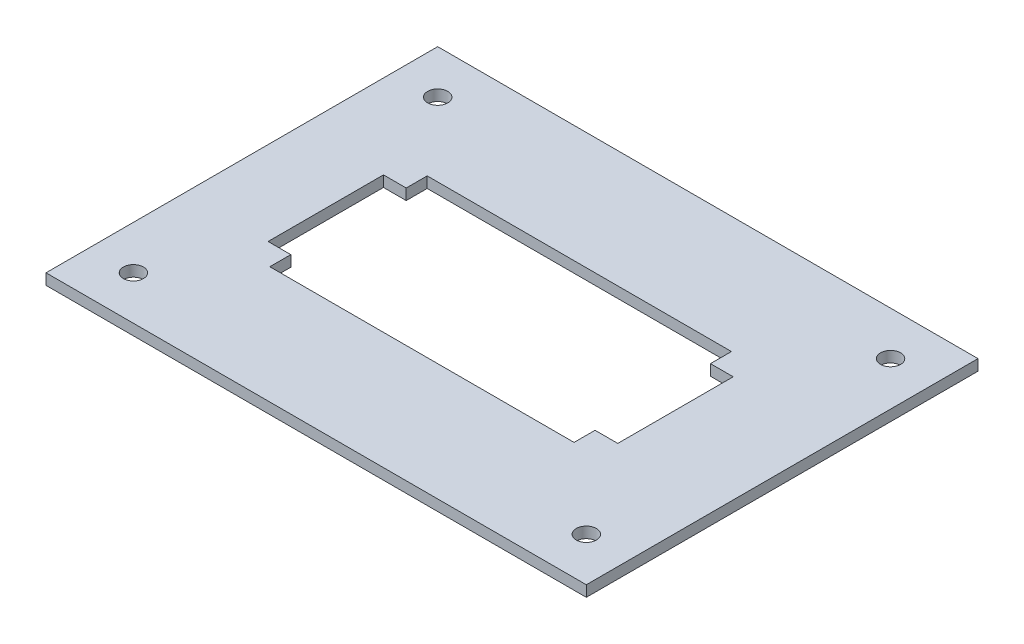
ISO-10303-21;
HEADER;
FILE_DESCRIPTION(('STEP AP214'),'2;1');
FILE_NAME('part.step','',(''),(''),'','','');
FILE_SCHEMA(('AUTOMOTIVE_DESIGN { 1 0 10303 214 1 1 1 1 }'));
ENDSEC;
DATA;
#1=APPLICATION_CONTEXT('core data for automotive mechanical design processes');
#2=APPLICATION_PROTOCOL_DEFINITION('international standard','automotive_design',2000,#1);
#3=PRODUCT_CONTEXT('',#1,'mechanical');
#4=PRODUCT('Part','Part','',(#3));
#5=PRODUCT_RELATED_PRODUCT_CATEGORY('part','',(#4));
#6=PRODUCT_DEFINITION_FORMATION('','',#4);
#7=PRODUCT_DEFINITION_CONTEXT('part definition',#1,'design');
#8=PRODUCT_DEFINITION('design','',#6,#7);
#9=PRODUCT_DEFINITION_SHAPE('','',#8);
#10=(LENGTH_UNIT() NAMED_UNIT(*) SI_UNIT(.MILLI.,.METRE.));
#11=(NAMED_UNIT(*) PLANE_ANGLE_UNIT() SI_UNIT($,.RADIAN.));
#12=(NAMED_UNIT(*) SI_UNIT($,.STERADIAN.) SOLID_ANGLE_UNIT());
#13=UNCERTAINTY_MEASURE_WITH_UNIT(LENGTH_MEASURE(1.E-05),#10,'distance_accuracy_value','');
#14=(GEOMETRIC_REPRESENTATION_CONTEXT(3) GLOBAL_UNCERTAINTY_ASSIGNED_CONTEXT((#13)) GLOBAL_UNIT_ASSIGNED_CONTEXT((#10,
#11,#12)) REPRESENTATION_CONTEXT('',''));
#15=CARTESIAN_POINT('',(0.,0.,0.));
#16=DIRECTION('',(0.,0.,1.));
#17=DIRECTION('',(1.,0.,0.));
#18=AXIS2_PLACEMENT_3D('',#15,#16,#17);
#19=CARTESIAN_POINT('',(0.,1.5875,0.));
#20=DIRECTION('',(0.,-1.,0.));
#21=DIRECTION('',(0.,0.,-1.));
#22=AXIS2_PLACEMENT_3D('',#19,#20,#21);
#23=PLANE('',#22);
#24=CARTESIAN_POINT('',(6.35,1.5875,-6.35));
#25=DIRECTION('',(0.,1.,0.));
#26=DIRECTION('',(0.,0.,1.));
#27=AXIS2_PLACEMENT_3D('',#24,#25,#26);
#28=CIRCLE('',#27,1.4605);
#29=CARTESIAN_POINT('',(6.35,1.5875,-4.8895));
#30=VERTEX_POINT('',#29);
#31=EDGE_CURVE('E388',#30,#30,#28,.T.);
#32=ORIENTED_EDGE('',*,*,#31,.F.);
#33=EDGE_LOOP('',(#32));
#34=FACE_BOUND('',#33,.T.);
#35=CARTESIAN_POINT('',(72.136,1.5875,-50.546));
#36=DIRECTION('',(0.,1.,0.));
#37=DIRECTION('',(0.,0.,1.));
#38=AXIS2_PLACEMENT_3D('',#35,#36,#37);
#39=CIRCLE('',#38,1.4605);
#40=CARTESIAN_POINT('',(72.136,1.5875,-49.0855));
#41=VERTEX_POINT('',#40);
#42=EDGE_CURVE('E381',#41,#41,#39,.T.);
#43=ORIENTED_EDGE('',*,*,#42,.F.);
#44=EDGE_LOOP('',(#43));
#45=FACE_BOUND('',#44,.T.);
#46=CARTESIAN_POINT('',(72.136,1.5875,-6.35));
#47=DIRECTION('',(0.,1.,0.));
#48=DIRECTION('',(0.,0.,1.));
#49=AXIS2_PLACEMENT_3D('',#46,#47,#48);
#50=CIRCLE('',#49,1.4605);
#51=CARTESIAN_POINT('',(72.136,1.5875,-4.8895));
#52=VERTEX_POINT('',#51);
#53=EDGE_CURVE('E378',#52,#52,#50,.T.);
#54=ORIENTED_EDGE('',*,*,#53,.F.);
#55=EDGE_LOOP('',(#54));
#56=FACE_BOUND('',#55,.T.);
#57=CARTESIAN_POINT('',(6.35,1.5875,-50.546));
#58=DIRECTION('',(0.,1.,0.));
#59=DIRECTION('',(0.,0.,1.));
#60=AXIS2_PLACEMENT_3D('',#57,#58,#59);
#61=CIRCLE('',#60,1.4605);
#62=CARTESIAN_POINT('',(6.35,1.5875,-49.0855));
#63=VERTEX_POINT('',#62);
#64=EDGE_CURVE('E387',#63,#63,#61,.T.);
#65=ORIENTED_EDGE('',*,*,#64,.F.);
#66=EDGE_LOOP('',(#65));
#67=FACE_BOUND('',#66,.T.);
#68=DIRECTION('',(0.,0.,1.));
#69=VECTOR('',#68,1.);
#70=CARTESIAN_POINT('',(0.,1.5875,0.));
#71=LINE('',#70,#69);
#72=CARTESIAN_POINT('',(0.,1.5875,-56.896));
#73=VERTEX_POINT('',#72);
#74=CARTESIAN_POINT('',(0.,1.5875,0.));
#75=VERTEX_POINT('',#74);
#76=EDGE_CURVE('E243',#73,#75,#71,.T.);
#77=ORIENTED_EDGE('',*,*,#76,.T.);
#78=DIRECTION('',(1.,0.,0.));
#79=VECTOR('',#78,1.);
#80=CARTESIAN_POINT('',(0.,1.5875,0.));
#81=LINE('',#80,#79);
#82=CARTESIAN_POINT('',(78.486,1.5875,0.));
#83=VERTEX_POINT('',#82);
#84=EDGE_CURVE('E246',#75,#83,#81,.T.);
#85=ORIENTED_EDGE('',*,*,#84,.T.);
#86=DIRECTION('',(0.,0.,-1.));
#87=VECTOR('',#86,1.);
#88=CARTESIAN_POINT('',(78.486,1.5875,0.));
#89=LINE('',#88,#87);
#90=CARTESIAN_POINT('',(78.486,1.5875,-56.896));
#91=VERTEX_POINT('',#90);
#92=EDGE_CURVE('E249',#83,#91,#89,.T.);
#93=ORIENTED_EDGE('',*,*,#92,.T.);
#94=DIRECTION('',(-1.,0.,0.));
#95=VECTOR('',#94,1.);
#96=CARTESIAN_POINT('',(0.,1.5875,-56.896));
#97=LINE('',#96,#95);
#98=EDGE_CURVE('E251',#91,#73,#97,.T.);
#99=ORIENTED_EDGE('',*,*,#98,.T.);
#100=EDGE_LOOP('',(#77,#85,#93,#99));
#101=FACE_BOUND('',#100,.T.);
#102=DIRECTION('',(0.,0.,1.));
#103=VECTOR('',#102,1.);
#104=CARTESIAN_POINT('',(15.494,1.5875,-36.83));
#105=LINE('',#104,#103);
#106=CARTESIAN_POINT('',(15.494,1.5875,-39.878));
#107=VERTEX_POINT('',#106);
#108=CARTESIAN_POINT('',(15.494,1.5875,-36.83));
#109=VERTEX_POINT('',#108);
#110=EDGE_CURVE('E148',#107,#109,#105,.T.);
#111=ORIENTED_EDGE('',*,*,#110,.F.);
#112=DIRECTION('',(-1.,0.,0.));
#113=VECTOR('',#112,1.);
#114=CARTESIAN_POINT('',(15.494,1.5875,-39.878));
#115=LINE('',#114,#113);
#116=CARTESIAN_POINT('',(59.69,1.5875,-39.878));
#117=VERTEX_POINT('',#116);
#118=EDGE_CURVE('E190',#117,#107,#115,.T.);
#119=ORIENTED_EDGE('',*,*,#118,.F.);
#120=DIRECTION('',(0.,0.,-1.));
#121=VECTOR('',#120,1.);
#122=CARTESIAN_POINT('',(59.69,1.5875,-39.878));
#123=LINE('',#122,#121);
#124=CARTESIAN_POINT('',(59.69,1.5875,-36.83));
#125=VERTEX_POINT('',#124);
#126=EDGE_CURVE('E188',#125,#117,#123,.T.);
#127=ORIENTED_EDGE('',*,*,#126,.F.);
#128=DIRECTION('',(-1.,0.,0.));
#129=VECTOR('',#128,1.);
#130=CARTESIAN_POINT('',(59.69,1.5875,-36.83));
#131=LINE('',#130,#129);
#132=CARTESIAN_POINT('',(62.992,1.5875,-36.83));
#133=VERTEX_POINT('',#132);
#134=EDGE_CURVE('E186',#133,#125,#131,.T.);
#135=ORIENTED_EDGE('',*,*,#134,.F.);
#136=DIRECTION('',(0.,0.,-1.));
#137=VECTOR('',#136,1.);
#138=CARTESIAN_POINT('',(62.992,1.5875,-36.83));
#139=LINE('',#138,#137);
#140=CARTESIAN_POINT('',(62.992,1.5875,-20.066));
#141=VERTEX_POINT('',#140);
#142=EDGE_CURVE('E184',#141,#133,#139,.T.);
#143=ORIENTED_EDGE('',*,*,#142,.F.);
#144=DIRECTION('',(1.,0.,0.));
#145=VECTOR('',#144,1.);
#146=CARTESIAN_POINT('',(62.992,1.5875,-20.066));
#147=LINE('',#146,#145);
#148=CARTESIAN_POINT('',(59.69,1.5875,-20.066));
#149=VERTEX_POINT('',#148);
#150=EDGE_CURVE('E182',#149,#141,#147,.T.);
#151=ORIENTED_EDGE('',*,*,#150,.F.);
#152=DIRECTION('',(0.,0.,-1.));
#153=VECTOR('',#152,1.);
#154=CARTESIAN_POINT('',(59.69,1.5875,-20.066));
#155=LINE('',#154,#153);
#156=CARTESIAN_POINT('',(59.69,1.5875,-17.018));
#157=VERTEX_POINT('',#156);
#158=EDGE_CURVE('E180',#157,#149,#155,.T.);
#159=ORIENTED_EDGE('',*,*,#158,.F.);
#160=DIRECTION('',(1.,0.,0.));
#161=VECTOR('',#160,1.);
#162=CARTESIAN_POINT('',(59.69,1.5875,-17.018));
#163=LINE('',#162,#161);
#164=CARTESIAN_POINT('',(15.494,1.5875,-17.018));
#165=VERTEX_POINT('',#164);
#166=EDGE_CURVE('E178',#165,#157,#163,.T.);
#167=ORIENTED_EDGE('',*,*,#166,.F.);
#168=DIRECTION('',(0.,0.,1.));
#169=VECTOR('',#168,1.);
#170=CARTESIAN_POINT('',(15.494,1.5875,-17.018));
#171=LINE('',#170,#169);
#172=CARTESIAN_POINT('',(15.494,1.5875,-20.066));
#173=VERTEX_POINT('',#172);
#174=EDGE_CURVE('E176',#173,#165,#171,.T.);
#175=ORIENTED_EDGE('',*,*,#174,.F.);
#176=DIRECTION('',(1.,0.,0.));
#177=VECTOR('',#176,1.);
#178=CARTESIAN_POINT('',(15.494,1.5875,-20.066));
#179=LINE('',#178,#177);
#180=CARTESIAN_POINT('',(12.192,1.5875,-20.066));
#181=VERTEX_POINT('',#180);
#182=EDGE_CURVE('E171',#181,#173,#179,.T.);
#183=ORIENTED_EDGE('',*,*,#182,.F.);
#184=DIRECTION('',(0.,0.,1.));
#185=VECTOR('',#184,1.);
#186=CARTESIAN_POINT('',(12.192,1.5875,-20.066));
#187=LINE('',#186,#185);
#188=CARTESIAN_POINT('',(12.192,1.5875,-36.83));
#189=VERTEX_POINT('',#188);
#190=EDGE_CURVE('E169',#189,#181,#187,.T.);
#191=ORIENTED_EDGE('',*,*,#190,.F.);
#192=DIRECTION('',(-1.,0.,0.));
#193=VECTOR('',#192,1.);
#194=CARTESIAN_POINT('',(12.192,1.5875,-36.83));
#195=LINE('',#194,#193);
#196=EDGE_CURVE('E156',#109,#189,#195,.T.);
#197=ORIENTED_EDGE('',*,*,#196,.F.);
#198=EDGE_LOOP('',(#111,#119,#127,#135,#143,#151,#159,#167,#175,#183,#191,#197));
#199=FACE_BOUND('',#198,.T.);
#200=ADVANCED_FACE('F35',(#34,#45,#56,#67,#101,#199),#23,.F.);
#201=CARTESIAN_POINT('',(0.,0.,0.));
#202=DIRECTION('',(0.,-1.,0.));
#203=DIRECTION('',(0.,0.,-1.));
#204=AXIS2_PLACEMENT_3D('',#201,#202,#203);
#205=PLANE('',#204);
#206=CARTESIAN_POINT('',(6.35,0.,-6.35));
#207=DIRECTION('',(0.,1.,0.));
#208=DIRECTION('',(0.,0.,1.));
#209=AXIS2_PLACEMENT_3D('',#206,#207,#208);
#210=CIRCLE('',#209,1.4605);
#211=CARTESIAN_POINT('',(6.35,0.,-4.8895));
#212=VERTEX_POINT('',#211);
#213=EDGE_CURVE('E384',#212,#212,#210,.T.);
#214=ORIENTED_EDGE('',*,*,#213,.T.);
#215=EDGE_LOOP('',(#214));
#216=FACE_BOUND('',#215,.T.);
#217=CARTESIAN_POINT('',(72.136,0.,-50.546));
#218=DIRECTION('',(0.,1.,0.));
#219=DIRECTION('',(0.,0.,1.));
#220=AXIS2_PLACEMENT_3D('',#217,#218,#219);
#221=CIRCLE('',#220,1.4605);
#222=CARTESIAN_POINT('',(72.136,0.,-49.0855));
#223=VERTEX_POINT('',#222);
#224=EDGE_CURVE('E391',#223,#223,#221,.T.);
#225=ORIENTED_EDGE('',*,*,#224,.T.);
#226=EDGE_LOOP('',(#225));
#227=FACE_BOUND('',#226,.T.);
#228=CARTESIAN_POINT('',(72.136,0.,-6.35));
#229=DIRECTION('',(0.,1.,0.));
#230=DIRECTION('',(0.,0.,1.));
#231=AXIS2_PLACEMENT_3D('',#228,#229,#230);
#232=CIRCLE('',#231,1.4605);
#233=CARTESIAN_POINT('',(72.136,0.,-4.8895));
#234=VERTEX_POINT('',#233);
#235=EDGE_CURVE('E375',#234,#234,#232,.T.);
#236=ORIENTED_EDGE('',*,*,#235,.T.);
#237=EDGE_LOOP('',(#236));
#238=FACE_BOUND('',#237,.T.);
#239=CARTESIAN_POINT('',(6.35,0.,-50.546));
#240=DIRECTION('',(0.,1.,0.));
#241=DIRECTION('',(0.,0.,1.));
#242=AXIS2_PLACEMENT_3D('',#239,#240,#241);
#243=CIRCLE('',#242,1.4605);
#244=CARTESIAN_POINT('',(6.35,0.,-49.0855));
#245=VERTEX_POINT('',#244);
#246=EDGE_CURVE('E193',#245,#245,#243,.T.);
#247=ORIENTED_EDGE('',*,*,#246,.T.);
#248=EDGE_LOOP('',(#247));
#249=FACE_BOUND('',#248,.T.);
#250=DIRECTION('',(0.,0.,1.));
#251=VECTOR('',#250,1.);
#252=CARTESIAN_POINT('',(0.,0.,0.));
#253=LINE('',#252,#251);
#254=CARTESIAN_POINT('',(0.,0.,-56.896));
#255=VERTEX_POINT('',#254);
#256=CARTESIAN_POINT('',(0.,0.,0.));
#257=VERTEX_POINT('',#256);
#258=EDGE_CURVE('E164',#255,#257,#253,.T.);
#259=ORIENTED_EDGE('',*,*,#258,.F.);
#260=DIRECTION('',(-1.,0.,0.));
#261=VECTOR('',#260,1.);
#262=CARTESIAN_POINT('',(0.,0.,-56.896));
#263=LINE('',#262,#261);
#264=CARTESIAN_POINT('',(78.486,0.,-56.896));
#265=VERTEX_POINT('',#264);
#266=EDGE_CURVE('E247',#265,#255,#263,.T.);
#267=ORIENTED_EDGE('',*,*,#266,.F.);
#268=DIRECTION('',(0.,0.,-1.));
#269=VECTOR('',#268,1.);
#270=CARTESIAN_POINT('',(78.486,0.,0.));
#271=LINE('',#270,#269);
#272=CARTESIAN_POINT('',(78.486,0.,0.));
#273=VERTEX_POINT('',#272);
#274=EDGE_CURVE('E258',#273,#265,#271,.T.);
#275=ORIENTED_EDGE('',*,*,#274,.F.);
#276=DIRECTION('',(1.,0.,0.));
#277=VECTOR('',#276,1.);
#278=CARTESIAN_POINT('',(0.,0.,0.));
#279=LINE('',#278,#277);
#280=EDGE_CURVE('E256',#257,#273,#279,.T.);
#281=ORIENTED_EDGE('',*,*,#280,.F.);
#282=EDGE_LOOP('',(#259,#267,#275,#281));
#283=FACE_BOUND('',#282,.T.);
#284=DIRECTION('',(-1.,0.,0.));
#285=VECTOR('',#284,1.);
#286=CARTESIAN_POINT('',(15.494,0.,-39.878));
#287=LINE('',#286,#285);
#288=CARTESIAN_POINT('',(59.69,0.,-39.878));
#289=VERTEX_POINT('',#288);
#290=CARTESIAN_POINT('',(15.494,0.,-39.878));
#291=VERTEX_POINT('',#290);
#292=EDGE_CURVE('E157',#289,#291,#287,.T.);
#293=ORIENTED_EDGE('',*,*,#292,.T.);
#294=DIRECTION('',(0.,0.,1.));
#295=VECTOR('',#294,1.);
#296=CARTESIAN_POINT('',(15.494,0.,-36.83));
#297=LINE('',#296,#295);
#298=CARTESIAN_POINT('',(15.494,0.,-36.83));
#299=VERTEX_POINT('',#298);
#300=EDGE_CURVE('E58',#291,#299,#297,.T.);
#301=ORIENTED_EDGE('',*,*,#300,.T.);
#302=DIRECTION('',(-1.,0.,0.));
#303=VECTOR('',#302,1.);
#304=CARTESIAN_POINT('',(12.192,0.,-36.83));
#305=LINE('',#304,#303);
#306=CARTESIAN_POINT('',(12.192,0.,-36.83));
#307=VERTEX_POINT('',#306);
#308=EDGE_CURVE('E163',#299,#307,#305,.T.);
#309=ORIENTED_EDGE('',*,*,#308,.T.);
#310=DIRECTION('',(0.,0.,1.));
#311=VECTOR('',#310,1.);
#312=CARTESIAN_POINT('',(12.192,0.,-20.066));
#313=LINE('',#312,#311);
#314=CARTESIAN_POINT('',(12.192,0.,-20.066));
#315=VERTEX_POINT('',#314);
#316=EDGE_CURVE('E195',#307,#315,#313,.T.);
#317=ORIENTED_EDGE('',*,*,#316,.T.);
#318=DIRECTION('',(1.,0.,0.));
#319=VECTOR('',#318,1.);
#320=CARTESIAN_POINT('',(15.494,0.,-20.066));
#321=LINE('',#320,#319);
#322=CARTESIAN_POINT('',(15.494,0.,-20.066));
#323=VERTEX_POINT('',#322);
#324=EDGE_CURVE('E198',#315,#323,#321,.T.);
#325=ORIENTED_EDGE('',*,*,#324,.T.);
#326=DIRECTION('',(0.,0.,1.));
#327=VECTOR('',#326,1.);
#328=CARTESIAN_POINT('',(15.494,0.,-17.018));
#329=LINE('',#328,#327);
#330=CARTESIAN_POINT('',(15.494,0.,-17.018));
#331=VERTEX_POINT('',#330);
#332=EDGE_CURVE('E201',#323,#331,#329,.T.);
#333=ORIENTED_EDGE('',*,*,#332,.T.);
#334=DIRECTION('',(1.,0.,0.));
#335=VECTOR('',#334,1.);
#336=CARTESIAN_POINT('',(59.69,0.,-17.018));
#337=LINE('',#336,#335);
#338=CARTESIAN_POINT('',(59.69,0.,-17.018));
#339=VERTEX_POINT('',#338);
#340=EDGE_CURVE('E204',#331,#339,#337,.T.);
#341=ORIENTED_EDGE('',*,*,#340,.T.);
#342=DIRECTION('',(0.,0.,-1.));
#343=VECTOR('',#342,1.);
#344=CARTESIAN_POINT('',(59.69,0.,-20.066));
#345=LINE('',#344,#343);
#346=CARTESIAN_POINT('',(59.69,0.,-20.066));
#347=VERTEX_POINT('',#346);
#348=EDGE_CURVE('E207',#339,#347,#345,.T.);
#349=ORIENTED_EDGE('',*,*,#348,.T.);
#350=DIRECTION('',(1.,0.,0.));
#351=VECTOR('',#350,1.);
#352=CARTESIAN_POINT('',(62.992,0.,-20.066));
#353=LINE('',#352,#351);
#354=CARTESIAN_POINT('',(62.992,0.,-20.066));
#355=VERTEX_POINT('',#354);
#356=EDGE_CURVE('E210',#347,#355,#353,.T.);
#357=ORIENTED_EDGE('',*,*,#356,.T.);
#358=DIRECTION('',(0.,0.,-1.));
#359=VECTOR('',#358,1.);
#360=CARTESIAN_POINT('',(62.992,0.,-36.83));
#361=LINE('',#360,#359);
#362=CARTESIAN_POINT('',(62.992,0.,-36.83));
#363=VERTEX_POINT('',#362);
#364=EDGE_CURVE('E213',#355,#363,#361,.T.);
#365=ORIENTED_EDGE('',*,*,#364,.T.);
#366=DIRECTION('',(-1.,0.,0.));
#367=VECTOR('',#366,1.);
#368=CARTESIAN_POINT('',(59.69,0.,-36.83));
#369=LINE('',#368,#367);
#370=CARTESIAN_POINT('',(59.69,0.,-36.83));
#371=VERTEX_POINT('',#370);
#372=EDGE_CURVE('E216',#363,#371,#369,.T.);
#373=ORIENTED_EDGE('',*,*,#372,.T.);
#374=DIRECTION('',(0.,0.,-1.));
#375=VECTOR('',#374,1.);
#376=CARTESIAN_POINT('',(59.69,0.,-39.878));
#377=LINE('',#376,#375);
#378=EDGE_CURVE('E219',#371,#289,#377,.T.);
#379=ORIENTED_EDGE('',*,*,#378,.T.);
#380=EDGE_LOOP('',(#293,#301,#309,#317,#325,#333,#341,#349,#357,#365,#373,#379));
#381=FACE_BOUND('',#380,.T.);
#382=ADVANCED_FACE('F276',(#216,#227,#238,#249,#283,#381),#205,.T.);
#383=CARTESIAN_POINT('',(0.,1.5875,0.));
#384=DIRECTION('',(1.,0.,0.));
#385=DIRECTION('',(0.,0.,-1.));
#386=AXIS2_PLACEMENT_3D('',#383,#384,#385);
#387=PLANE('',#386);
#388=ORIENTED_EDGE('',*,*,#258,.T.);
#389=DIRECTION('',(0.,-1.,0.));
#390=VECTOR('',#389,1.);
#391=CARTESIAN_POINT('',(0.,1.5875,0.));
#392=LINE('',#391,#390);
#393=EDGE_CURVE('E11',#75,#257,#392,.T.);
#394=ORIENTED_EDGE('',*,*,#393,.F.);
#395=ORIENTED_EDGE('',*,*,#76,.F.);
#396=DIRECTION('',(0.,-1.,0.));
#397=VECTOR('',#396,1.);
#398=CARTESIAN_POINT('',(0.,1.5875,-56.896));
#399=LINE('',#398,#397);
#400=EDGE_CURVE('E253',#73,#255,#399,.T.);
#401=ORIENTED_EDGE('',*,*,#400,.T.);
#402=EDGE_LOOP('',(#388,#394,#395,#401));
#403=FACE_BOUND('',#402,.T.);
#404=ADVANCED_FACE('F37',(#403),#387,.F.);
#405=CARTESIAN_POINT('',(0.,1.5875,0.));
#406=DIRECTION('',(0.,0.,-1.));
#407=DIRECTION('',(-1.,0.,0.));
#408=AXIS2_PLACEMENT_3D('',#405,#406,#407);
#409=PLANE('',#408);
#410=ORIENTED_EDGE('',*,*,#280,.T.);
#411=DIRECTION('',(0.,-1.,0.));
#412=VECTOR('',#411,1.);
#413=CARTESIAN_POINT('',(78.486,1.5875,0.));
#414=LINE('',#413,#412);
#415=EDGE_CURVE('E43',#83,#273,#414,.T.);
#416=ORIENTED_EDGE('',*,*,#415,.F.);
#417=ORIENTED_EDGE('',*,*,#84,.F.);
#418=ORIENTED_EDGE('',*,*,#393,.T.);
#419=EDGE_LOOP('',(#410,#416,#417,#418));
#420=FACE_BOUND('',#419,.T.);
#421=ADVANCED_FACE('F286',(#420),#409,.F.);
#422=CARTESIAN_POINT('',(78.486,1.5875,0.));
#423=DIRECTION('',(-1.,0.,0.));
#424=DIRECTION('',(0.,0.,1.));
#425=AXIS2_PLACEMENT_3D('',#422,#423,#424);
#426=PLANE('',#425);
#427=ORIENTED_EDGE('',*,*,#274,.T.);
#428=DIRECTION('',(0.,-1.,0.));
#429=VECTOR('',#428,1.);
#430=CARTESIAN_POINT('',(78.486,1.5875,-56.896));
#431=LINE('',#430,#429);
#432=EDGE_CURVE('E263',#91,#265,#431,.T.);
#433=ORIENTED_EDGE('',*,*,#432,.F.);
#434=ORIENTED_EDGE('',*,*,#92,.F.);
#435=ORIENTED_EDGE('',*,*,#415,.T.);
#436=EDGE_LOOP('',(#427,#433,#434,#435));
#437=FACE_BOUND('',#436,.T.);
#438=ADVANCED_FACE('F270',(#437),#426,.F.);
#439=CARTESIAN_POINT('',(0.,1.5875,-56.896));
#440=DIRECTION('',(0.,0.,1.));
#441=DIRECTION('',(1.,0.,0.));
#442=AXIS2_PLACEMENT_3D('',#439,#440,#441);
#443=PLANE('',#442);
#444=ORIENTED_EDGE('',*,*,#266,.T.);
#445=ORIENTED_EDGE('',*,*,#400,.F.);
#446=ORIENTED_EDGE('',*,*,#98,.F.);
#447=ORIENTED_EDGE('',*,*,#432,.T.);
#448=EDGE_LOOP('',(#444,#445,#446,#447));
#449=FACE_BOUND('',#448,.T.);
#450=ADVANCED_FACE('F280',(#449),#443,.F.);
#451=CARTESIAN_POINT('',(15.494,1.5875,-36.83));
#452=DIRECTION('',(1.,0.,0.));
#453=DIRECTION('',(0.,0.,-1.));
#454=AXIS2_PLACEMENT_3D('',#451,#452,#453);
#455=PLANE('',#454);
#456=ORIENTED_EDGE('',*,*,#300,.F.);
#457=DIRECTION('',(0.,-1.,0.));
#458=VECTOR('',#457,1.);
#459=CARTESIAN_POINT('',(15.494,1.5875,-39.878));
#460=LINE('',#459,#458);
#461=EDGE_CURVE('E152',#107,#291,#460,.T.);
#462=ORIENTED_EDGE('',*,*,#461,.F.);
#463=ORIENTED_EDGE('',*,*,#110,.T.);
#464=DIRECTION('',(0.,-1.,0.));
#465=VECTOR('',#464,1.);
#466=CARTESIAN_POINT('',(15.494,1.5875,-36.83));
#467=LINE('',#466,#465);
#468=EDGE_CURVE('E151',#109,#299,#467,.T.);
#469=ORIENTED_EDGE('',*,*,#468,.T.);
#470=EDGE_LOOP('',(#456,#462,#463,#469));
#471=FACE_BOUND('',#470,.T.);
#472=ADVANCED_FACE('F150',(#471),#455,.T.);
#473=CARTESIAN_POINT('',(12.192,1.5875,-36.83));
#474=DIRECTION('',(0.,0.,1.));
#475=DIRECTION('',(1.,0.,0.));
#476=AXIS2_PLACEMENT_3D('',#473,#474,#475);
#477=PLANE('',#476);
#478=ORIENTED_EDGE('',*,*,#308,.F.);
#479=ORIENTED_EDGE('',*,*,#468,.F.);
#480=ORIENTED_EDGE('',*,*,#196,.T.);
#481=DIRECTION('',(0.,-1.,0.));
#482=VECTOR('',#481,1.);
#483=CARTESIAN_POINT('',(12.192,1.5875,-36.83));
#484=LINE('',#483,#482);
#485=EDGE_CURVE('E165',#189,#307,#484,.T.);
#486=ORIENTED_EDGE('',*,*,#485,.T.);
#487=EDGE_LOOP('',(#478,#479,#480,#486));
#488=FACE_BOUND('',#487,.T.);
#489=ADVANCED_FACE('F160',(#488),#477,.T.);
#490=CARTESIAN_POINT('',(12.192,1.5875,-20.066));
#491=DIRECTION('',(1.,0.,0.));
#492=DIRECTION('',(0.,0.,-1.));
#493=AXIS2_PLACEMENT_3D('',#490,#491,#492);
#494=PLANE('',#493);
#495=ORIENTED_EDGE('',*,*,#316,.F.);
#496=ORIENTED_EDGE('',*,*,#485,.F.);
#497=ORIENTED_EDGE('',*,*,#190,.T.);
#498=DIRECTION('',(0.,-1.,0.));
#499=VECTOR('',#498,1.);
#500=CARTESIAN_POINT('',(12.192,1.5875,-20.066));
#501=LINE('',#500,#499);
#502=EDGE_CURVE('E240',#181,#315,#501,.T.);
#503=ORIENTED_EDGE('',*,*,#502,.T.);
#504=EDGE_LOOP('',(#495,#496,#497,#503));
#505=FACE_BOUND('',#504,.T.);
#506=ADVANCED_FACE('F313',(#505),#494,.T.);
#507=CARTESIAN_POINT('',(15.494,1.5875,-20.066));
#508=DIRECTION('',(0.,0.,-1.));
#509=DIRECTION('',(-1.,0.,0.));
#510=AXIS2_PLACEMENT_3D('',#507,#508,#509);
#511=PLANE('',#510);
#512=ORIENTED_EDGE('',*,*,#324,.F.);
#513=ORIENTED_EDGE('',*,*,#502,.F.);
#514=ORIENTED_EDGE('',*,*,#182,.T.);
#515=DIRECTION('',(0.,-1.,0.));
#516=VECTOR('',#515,1.);
#517=CARTESIAN_POINT('',(15.494,1.5875,-20.066));
#518=LINE('',#517,#516);
#519=EDGE_CURVE('E238',#173,#323,#518,.T.);
#520=ORIENTED_EDGE('',*,*,#519,.T.);
#521=EDGE_LOOP('',(#512,#513,#514,#520));
#522=FACE_BOUND('',#521,.T.);
#523=ADVANCED_FACE('F317',(#522),#511,.T.);
#524=CARTESIAN_POINT('',(15.494,1.5875,-17.018));
#525=DIRECTION('',(1.,0.,0.));
#526=DIRECTION('',(0.,0.,-1.));
#527=AXIS2_PLACEMENT_3D('',#524,#525,#526);
#528=PLANE('',#527);
#529=ORIENTED_EDGE('',*,*,#332,.F.);
#530=ORIENTED_EDGE('',*,*,#519,.F.);
#531=ORIENTED_EDGE('',*,*,#174,.T.);
#532=DIRECTION('',(0.,-1.,0.));
#533=VECTOR('',#532,1.);
#534=CARTESIAN_POINT('',(15.494,1.5875,-17.018));
#535=LINE('',#534,#533);
#536=EDGE_CURVE('E236',#165,#331,#535,.T.);
#537=ORIENTED_EDGE('',*,*,#536,.T.);
#538=EDGE_LOOP('',(#529,#530,#531,#537));
#539=FACE_BOUND('',#538,.T.);
#540=ADVANCED_FACE('F323',(#539),#528,.T.);
#541=CARTESIAN_POINT('',(59.69,1.5875,-17.018));
#542=DIRECTION('',(0.,0.,-1.));
#543=DIRECTION('',(-1.,0.,0.));
#544=AXIS2_PLACEMENT_3D('',#541,#542,#543);
#545=PLANE('',#544);
#546=ORIENTED_EDGE('',*,*,#340,.F.);
#547=ORIENTED_EDGE('',*,*,#536,.F.);
#548=ORIENTED_EDGE('',*,*,#166,.T.);
#549=DIRECTION('',(0.,-1.,0.));
#550=VECTOR('',#549,1.);
#551=CARTESIAN_POINT('',(59.69,1.5875,-17.018));
#552=LINE('',#551,#550);
#553=EDGE_CURVE('E234',#157,#339,#552,.T.);
#554=ORIENTED_EDGE('',*,*,#553,.T.);
#555=EDGE_LOOP('',(#546,#547,#548,#554));
#556=FACE_BOUND('',#555,.T.);
#557=ADVANCED_FACE('F327',(#556),#545,.T.);
#558=CARTESIAN_POINT('',(59.69,1.5875,-20.066));
#559=DIRECTION('',(-1.,0.,0.));
#560=DIRECTION('',(0.,0.,1.));
#561=AXIS2_PLACEMENT_3D('',#558,#559,#560);
#562=PLANE('',#561);
#563=ORIENTED_EDGE('',*,*,#348,.F.);
#564=ORIENTED_EDGE('',*,*,#553,.F.);
#565=ORIENTED_EDGE('',*,*,#158,.T.);
#566=DIRECTION('',(0.,-1.,0.));
#567=VECTOR('',#566,1.);
#568=CARTESIAN_POINT('',(59.69,1.5875,-20.066));
#569=LINE('',#568,#567);
#570=EDGE_CURVE('E232',#149,#347,#569,.T.);
#571=ORIENTED_EDGE('',*,*,#570,.T.);
#572=EDGE_LOOP('',(#563,#564,#565,#571));
#573=FACE_BOUND('',#572,.T.);
#574=ADVANCED_FACE('F331',(#573),#562,.T.);
#575=CARTESIAN_POINT('',(62.992,1.5875,-20.066));
#576=DIRECTION('',(0.,0.,-1.));
#577=DIRECTION('',(-1.,0.,0.));
#578=AXIS2_PLACEMENT_3D('',#575,#576,#577);
#579=PLANE('',#578);
#580=ORIENTED_EDGE('',*,*,#356,.F.);
#581=ORIENTED_EDGE('',*,*,#570,.F.);
#582=ORIENTED_EDGE('',*,*,#150,.T.);
#583=DIRECTION('',(0.,-1.,0.));
#584=VECTOR('',#583,1.);
#585=CARTESIAN_POINT('',(62.992,1.5875,-20.066));
#586=LINE('',#585,#584);
#587=EDGE_CURVE('E230',#141,#355,#586,.T.);
#588=ORIENTED_EDGE('',*,*,#587,.T.);
#589=EDGE_LOOP('',(#580,#581,#582,#588));
#590=FACE_BOUND('',#589,.T.);
#591=ADVANCED_FACE('F335',(#590),#579,.T.);
#592=CARTESIAN_POINT('',(62.992,1.5875,-36.83));
#593=DIRECTION('',(-1.,0.,0.));
#594=DIRECTION('',(0.,0.,1.));
#595=AXIS2_PLACEMENT_3D('',#592,#593,#594);
#596=PLANE('',#595);
#597=ORIENTED_EDGE('',*,*,#364,.F.);
#598=ORIENTED_EDGE('',*,*,#587,.F.);
#599=ORIENTED_EDGE('',*,*,#142,.T.);
#600=DIRECTION('',(0.,-1.,0.));
#601=VECTOR('',#600,1.);
#602=CARTESIAN_POINT('',(62.992,1.5875,-36.83));
#603=LINE('',#602,#601);
#604=EDGE_CURVE('E228',#133,#363,#603,.T.);
#605=ORIENTED_EDGE('',*,*,#604,.T.);
#606=EDGE_LOOP('',(#597,#598,#599,#605));
#607=FACE_BOUND('',#606,.T.);
#608=ADVANCED_FACE('F339',(#607),#596,.T.);
#609=CARTESIAN_POINT('',(59.69,1.5875,-36.83));
#610=DIRECTION('',(0.,0.,1.));
#611=DIRECTION('',(1.,0.,0.));
#612=AXIS2_PLACEMENT_3D('',#609,#610,#611);
#613=PLANE('',#612);
#614=ORIENTED_EDGE('',*,*,#372,.F.);
#615=ORIENTED_EDGE('',*,*,#604,.F.);
#616=ORIENTED_EDGE('',*,*,#134,.T.);
#617=DIRECTION('',(0.,-1.,0.));
#618=VECTOR('',#617,1.);
#619=CARTESIAN_POINT('',(59.69,1.5875,-36.83));
#620=LINE('',#619,#618);
#621=EDGE_CURVE('E226',#125,#371,#620,.T.);
#622=ORIENTED_EDGE('',*,*,#621,.T.);
#623=EDGE_LOOP('',(#614,#615,#616,#622));
#624=FACE_BOUND('',#623,.T.);
#625=ADVANCED_FACE('F343',(#624),#613,.T.);
#626=CARTESIAN_POINT('',(59.69,1.5875,-39.878));
#627=DIRECTION('',(-1.,0.,0.));
#628=DIRECTION('',(0.,0.,1.));
#629=AXIS2_PLACEMENT_3D('',#626,#627,#628);
#630=PLANE('',#629);
#631=ORIENTED_EDGE('',*,*,#378,.F.);
#632=ORIENTED_EDGE('',*,*,#621,.F.);
#633=ORIENTED_EDGE('',*,*,#126,.T.);
#634=DIRECTION('',(0.,-1.,0.));
#635=VECTOR('',#634,1.);
#636=CARTESIAN_POINT('',(59.69,1.5875,-39.878));
#637=LINE('',#636,#635);
#638=EDGE_CURVE('E50',#117,#289,#637,.T.);
#639=ORIENTED_EDGE('',*,*,#638,.T.);
#640=EDGE_LOOP('',(#631,#632,#633,#639));
#641=FACE_BOUND('',#640,.T.);
#642=ADVANCED_FACE('F347',(#641),#630,.T.);
#643=CARTESIAN_POINT('',(15.494,1.5875,-39.878));
#644=DIRECTION('',(0.,0.,1.));
#645=DIRECTION('',(1.,0.,0.));
#646=AXIS2_PLACEMENT_3D('',#643,#644,#645);
#647=PLANE('',#646);
#648=ORIENTED_EDGE('',*,*,#292,.F.);
#649=ORIENTED_EDGE('',*,*,#638,.F.);
#650=ORIENTED_EDGE('',*,*,#118,.T.);
#651=ORIENTED_EDGE('',*,*,#461,.T.);
#652=EDGE_LOOP('',(#648,#649,#650,#651));
#653=FACE_BOUND('',#652,.T.);
#654=ADVANCED_FACE('F351',(#653),#647,.T.);
#655=CARTESIAN_POINT('',(6.35,0.,-50.546));
#656=DIRECTION('',(0.,1.,0.));
#657=DIRECTION('',(0.,0.,1.));
#658=AXIS2_PLACEMENT_3D('',#655,#656,#657);
#659=CYLINDRICAL_SURFACE('',#658,1.4605);
#660=ORIENTED_EDGE('',*,*,#246,.F.);
#661=EDGE_LOOP('',(#660));
#662=FACE_BOUND('',#661,.T.);
#663=ORIENTED_EDGE('',*,*,#64,.T.);
#664=EDGE_LOOP('',(#663));
#665=FACE_BOUND('',#664,.T.);
#666=ADVANCED_FACE('F355',(#662,#665),#659,.F.);
#667=CARTESIAN_POINT('',(72.136,0.,-6.35));
#668=DIRECTION('',(0.,1.,0.));
#669=DIRECTION('',(0.,0.,1.));
#670=AXIS2_PLACEMENT_3D('',#667,#668,#669);
#671=CYLINDRICAL_SURFACE('',#670,1.4605);
#672=ORIENTED_EDGE('',*,*,#235,.F.);
#673=EDGE_LOOP('',(#672));
#674=FACE_BOUND('',#673,.T.);
#675=ORIENTED_EDGE('',*,*,#53,.T.);
#676=EDGE_LOOP('',(#675));
#677=FACE_BOUND('',#676,.T.);
#678=ADVANCED_FACE('F358',(#674,#677),#671,.F.);
#679=CARTESIAN_POINT('',(72.136,0.,-50.546));
#680=DIRECTION('',(0.,1.,0.));
#681=DIRECTION('',(0.,0.,1.));
#682=AXIS2_PLACEMENT_3D('',#679,#680,#681);
#683=CYLINDRICAL_SURFACE('',#682,1.4605);
#684=ORIENTED_EDGE('',*,*,#224,.F.);
#685=EDGE_LOOP('',(#684));
#686=FACE_BOUND('',#685,.T.);
#687=ORIENTED_EDGE('',*,*,#42,.T.);
#688=EDGE_LOOP('',(#687));
#689=FACE_BOUND('',#688,.T.);
#690=ADVANCED_FACE('F360',(#686,#689),#683,.F.);
#691=CARTESIAN_POINT('',(6.35,0.,-6.35));
#692=DIRECTION('',(0.,1.,0.));
#693=DIRECTION('',(0.,0.,1.));
#694=AXIS2_PLACEMENT_3D('',#691,#692,#693);
#695=CYLINDRICAL_SURFACE('',#694,1.4605);
#696=ORIENTED_EDGE('',*,*,#213,.F.);
#697=EDGE_LOOP('',(#696));
#698=FACE_BOUND('',#697,.T.);
#699=ORIENTED_EDGE('',*,*,#31,.T.);
#700=EDGE_LOOP('',(#699));
#701=FACE_BOUND('',#700,.T.);
#702=ADVANCED_FACE('F363',(#698,#701),#695,.F.);
#703=CLOSED_SHELL('',(#200,#382,#404,#421,#438,#450,#472,#489,#506,#523,#540,#557,#574,#591,
#608,#625,#642,#654,#666,#678,#690,#702));
#704=MANIFOLD_SOLID_BREP('B2',#703);
#705=ADVANCED_BREP_SHAPE_REPRESENTATION('',(#18,#704),#14);
#706=SHAPE_DEFINITION_REPRESENTATION(#9,#705);
ENDSEC;
END-ISO-10303-21;
